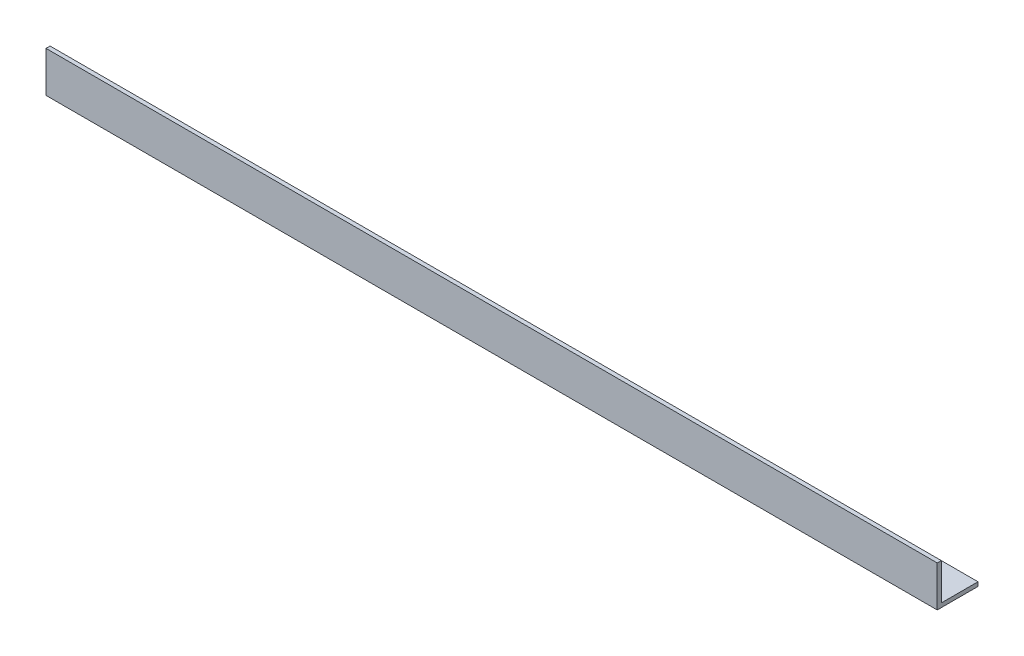
ISO-10303-21;
HEADER;
FILE_DESCRIPTION(('STEP AP214'),'2;1');
FILE_NAME('part.step','',(''),(''),'','','');
FILE_SCHEMA(('AUTOMOTIVE_DESIGN { 1 0 10303 214 1 1 1 1 }'));
ENDSEC;
DATA;
#1=APPLICATION_CONTEXT('core data for automotive mechanical design processes');
#2=APPLICATION_PROTOCOL_DEFINITION('international standard','automotive_design',2000,#1);
#3=PRODUCT_CONTEXT('',#1,'mechanical');
#4=PRODUCT('Part','Part','',(#3));
#5=PRODUCT_RELATED_PRODUCT_CATEGORY('part','',(#4));
#6=PRODUCT_DEFINITION_FORMATION('','',#4);
#7=PRODUCT_DEFINITION_CONTEXT('part definition',#1,'design');
#8=PRODUCT_DEFINITION('design','',#6,#7);
#9=PRODUCT_DEFINITION_SHAPE('','',#8);
#10=(LENGTH_UNIT() NAMED_UNIT(*) SI_UNIT(.MILLI.,.METRE.));
#11=(NAMED_UNIT(*) PLANE_ANGLE_UNIT() SI_UNIT($,.RADIAN.));
#12=(NAMED_UNIT(*) SI_UNIT($,.STERADIAN.) SOLID_ANGLE_UNIT());
#13=UNCERTAINTY_MEASURE_WITH_UNIT(LENGTH_MEASURE(1.E-05),#10,'distance_accuracy_value','');
#14=(GEOMETRIC_REPRESENTATION_CONTEXT(3) GLOBAL_UNCERTAINTY_ASSIGNED_CONTEXT((#13)) GLOBAL_UNIT_ASSIGNED_CONTEXT((#10,
#11,#12)) REPRESENTATION_CONTEXT('',''));
#15=CARTESIAN_POINT('',(0.,0.,0.));
#16=DIRECTION('',(0.,0.,1.));
#17=DIRECTION('',(1.,0.,0.));
#18=AXIS2_PLACEMENT_3D('',#15,#16,#17);
#19=CARTESIAN_POINT('',(328.,0.,-15.));
#20=DIRECTION('',(0.,1.,0.));
#21=DIRECTION('',(0.,0.,1.));
#22=AXIS2_PLACEMENT_3D('',#19,#20,#21);
#23=PLANE('',#22);
#24=DIRECTION('',(0.,0.,-1.));
#25=VECTOR('',#24,1.);
#26=CARTESIAN_POINT('',(0.,0.,-15.));
#27=LINE('',#26,#25);
#28=CARTESIAN_POINT('',(0.,0.,0.));
#29=VERTEX_POINT('',#28);
#30=CARTESIAN_POINT('',(0.,0.,-15.));
#31=VERTEX_POINT('',#30);
#32=EDGE_CURVE('E118',#29,#31,#27,.T.);
#33=ORIENTED_EDGE('',*,*,#32,.T.);
#34=DIRECTION('',(-1.,0.,0.));
#35=VECTOR('',#34,1.);
#36=CARTESIAN_POINT('',(328.,0.,-15.));
#37=LINE('',#36,#35);
#38=CARTESIAN_POINT('',(328.,0.,-15.));
#39=VERTEX_POINT('',#38);
#40=EDGE_CURVE('E11',#39,#31,#37,.T.);
#41=ORIENTED_EDGE('',*,*,#40,.F.);
#42=DIRECTION('',(0.,0.,-1.));
#43=VECTOR('',#42,1.);
#44=CARTESIAN_POINT('',(328.,0.,-15.));
#45=LINE('',#44,#43);
#46=CARTESIAN_POINT('',(328.,0.,0.));
#47=VERTEX_POINT('',#46);
#48=EDGE_CURVE('E128',#47,#39,#45,.T.);
#49=ORIENTED_EDGE('',*,*,#48,.F.);
#50=DIRECTION('',(-1.,0.,0.));
#51=VECTOR('',#50,1.);
#52=CARTESIAN_POINT('',(328.,0.,0.));
#53=LINE('',#52,#51);
#54=EDGE_CURVE('E114',#47,#29,#53,.T.);
#55=ORIENTED_EDGE('',*,*,#54,.T.);
#56=EDGE_LOOP('',(#33,#41,#49,#55));
#57=FACE_BOUND('',#56,.T.);
#58=ADVANCED_FACE('F34',(#57),#23,.F.);
#59=CARTESIAN_POINT('',(328.,1.49999999999998,-15.));
#60=DIRECTION('',(0.,0.,1.));
#61=DIRECTION('',(1.,0.,0.));
#62=AXIS2_PLACEMENT_3D('',#59,#60,#61);
#63=PLANE('',#62);
#64=DIRECTION('',(0.,1.,0.));
#65=VECTOR('',#64,1.);
#66=CARTESIAN_POINT('',(0.,1.49999999999998,-15.));
#67=LINE('',#66,#65);
#68=CARTESIAN_POINT('',(0.,1.49999999999998,-15.));
#69=VERTEX_POINT('',#68);
#70=EDGE_CURVE('E121',#31,#69,#67,.T.);
#71=ORIENTED_EDGE('',*,*,#70,.T.);
#72=DIRECTION('',(-1.,0.,0.));
#73=VECTOR('',#72,1.);
#74=CARTESIAN_POINT('',(328.,1.49999999999998,-15.));
#75=LINE('',#74,#73);
#76=CARTESIAN_POINT('',(328.,1.49999999999998,-15.));
#77=VERTEX_POINT('',#76);
#78=EDGE_CURVE('E42',#77,#69,#75,.T.);
#79=ORIENTED_EDGE('',*,*,#78,.F.);
#80=DIRECTION('',(0.,1.,0.));
#81=VECTOR('',#80,1.);
#82=CARTESIAN_POINT('',(328.,1.49999999999998,-15.));
#83=LINE('',#82,#81);
#84=EDGE_CURVE('E87',#39,#77,#83,.T.);
#85=ORIENTED_EDGE('',*,*,#84,.F.);
#86=ORIENTED_EDGE('',*,*,#40,.T.);
#87=EDGE_LOOP('',(#71,#79,#85,#86));
#88=FACE_BOUND('',#87,.T.);
#89=ADVANCED_FACE('F152',(#88),#63,.F.);
#90=CARTESIAN_POINT('',(328.,1.5,-1.50000000000002));
#91=DIRECTION('',(0.,-1.,0.));
#92=DIRECTION('',(0.,0.,-1.));
#93=AXIS2_PLACEMENT_3D('',#90,#91,#92);
#94=PLANE('',#93);
#95=DIRECTION('',(0.,0.,1.));
#96=VECTOR('',#95,1.);
#97=CARTESIAN_POINT('',(0.,1.5,-1.50000000000002));
#98=LINE('',#97,#96);
#99=CARTESIAN_POINT('',(0.,1.5,-1.50000000000002));
#100=VERTEX_POINT('',#99);
#101=EDGE_CURVE('E123',#69,#100,#98,.T.);
#102=ORIENTED_EDGE('',*,*,#101,.T.);
#103=DIRECTION('',(-1.,0.,0.));
#104=VECTOR('',#103,1.);
#105=CARTESIAN_POINT('',(328.,1.5,-1.50000000000002));
#106=LINE('',#105,#104);
#107=CARTESIAN_POINT('',(328.,1.5,-1.50000000000002));
#108=VERTEX_POINT('',#107);
#109=EDGE_CURVE('E109',#108,#100,#106,.T.);
#110=ORIENTED_EDGE('',*,*,#109,.F.);
#111=DIRECTION('',(0.,0.,1.));
#112=VECTOR('',#111,1.);
#113=CARTESIAN_POINT('',(328.,1.5,-1.50000000000002));
#114=LINE('',#113,#112);
#115=EDGE_CURVE('E100',#77,#108,#114,.T.);
#116=ORIENTED_EDGE('',*,*,#115,.F.);
#117=ORIENTED_EDGE('',*,*,#78,.T.);
#118=EDGE_LOOP('',(#102,#110,#116,#117));
#119=FACE_BOUND('',#118,.T.);
#120=ADVANCED_FACE('F134',(#119),#94,.F.);
#121=CARTESIAN_POINT('',(328.,15.,-1.5));
#122=DIRECTION('',(0.,0.,1.));
#123=DIRECTION('',(0.,-1.,0.));
#124=AXIS2_PLACEMENT_3D('',#121,#122,#123);
#125=PLANE('',#124);
#126=DIRECTION('',(0.,1.,0.));
#127=VECTOR('',#126,1.);
#128=CARTESIAN_POINT('',(0.,15.,-1.5));
#129=LINE('',#128,#127);
#130=CARTESIAN_POINT('',(0.,15.,-1.5));
#131=VERTEX_POINT('',#130);
#132=EDGE_CURVE('E108',#100,#131,#129,.T.);
#133=ORIENTED_EDGE('',*,*,#132,.T.);
#134=DIRECTION('',(-1.,0.,0.));
#135=VECTOR('',#134,1.);
#136=CARTESIAN_POINT('',(328.,15.,-1.5));
#137=LINE('',#136,#135);
#138=CARTESIAN_POINT('',(328.,15.,-1.5));
#139=VERTEX_POINT('',#138);
#140=EDGE_CURVE('E105',#139,#131,#137,.T.);
#141=ORIENTED_EDGE('',*,*,#140,.F.);
#142=DIRECTION('',(0.,1.,0.));
#143=VECTOR('',#142,1.);
#144=CARTESIAN_POINT('',(328.,15.,-1.5));
#145=LINE('',#144,#143);
#146=EDGE_CURVE('E94',#108,#139,#145,.T.);
#147=ORIENTED_EDGE('',*,*,#146,.F.);
#148=ORIENTED_EDGE('',*,*,#109,.T.);
#149=EDGE_LOOP('',(#133,#141,#147,#148));
#150=FACE_BOUND('',#149,.T.);
#151=ADVANCED_FACE('F106',(#150),#125,.F.);
#152=CARTESIAN_POINT('',(328.,15.,0.));
#153=DIRECTION('',(0.,-1.,0.));
#154=DIRECTION('',(0.,0.,-1.));
#155=AXIS2_PLACEMENT_3D('',#152,#153,#154);
#156=PLANE('',#155);
#157=DIRECTION('',(0.,0.,1.));
#158=VECTOR('',#157,1.);
#159=CARTESIAN_POINT('',(0.,15.,0.));
#160=LINE('',#159,#158);
#161=CARTESIAN_POINT('',(0.,15.,0.));
#162=VERTEX_POINT('',#161);
#163=EDGE_CURVE('E73',#131,#162,#160,.T.);
#164=ORIENTED_EDGE('',*,*,#163,.T.);
#165=DIRECTION('',(-1.,0.,0.));
#166=VECTOR('',#165,1.);
#167=CARTESIAN_POINT('',(328.,15.,0.));
#168=LINE('',#167,#166);
#169=CARTESIAN_POINT('',(328.,15.,0.));
#170=VERTEX_POINT('',#169);
#171=EDGE_CURVE('E110',#170,#162,#168,.T.);
#172=ORIENTED_EDGE('',*,*,#171,.F.);
#173=DIRECTION('',(0.,0.,1.));
#174=VECTOR('',#173,1.);
#175=CARTESIAN_POINT('',(328.,15.,0.));
#176=LINE('',#175,#174);
#177=EDGE_CURVE('E98',#139,#170,#176,.T.);
#178=ORIENTED_EDGE('',*,*,#177,.F.);
#179=ORIENTED_EDGE('',*,*,#140,.T.);
#180=EDGE_LOOP('',(#164,#172,#178,#179));
#181=FACE_BOUND('',#180,.T.);
#182=ADVANCED_FACE('F112',(#181),#156,.F.);
#183=CARTESIAN_POINT('',(328.,0.,0.));
#184=DIRECTION('',(0.,0.,-1.));
#185=DIRECTION('',(-1.,0.,0.));
#186=AXIS2_PLACEMENT_3D('',#183,#184,#185);
#187=PLANE('',#186);
#188=DIRECTION('',(0.,-1.,0.));
#189=VECTOR('',#188,1.);
#190=CARTESIAN_POINT('',(0.,0.,0.));
#191=LINE('',#190,#189);
#192=EDGE_CURVE('E79',#162,#29,#191,.T.);
#193=ORIENTED_EDGE('',*,*,#192,.T.);
#194=ORIENTED_EDGE('',*,*,#54,.F.);
#195=DIRECTION('',(0.,-1.,0.));
#196=VECTOR('',#195,1.);
#197=CARTESIAN_POINT('',(328.,0.,0.));
#198=LINE('',#197,#196);
#199=EDGE_CURVE('E50',#170,#47,#198,.T.);
#200=ORIENTED_EDGE('',*,*,#199,.F.);
#201=ORIENTED_EDGE('',*,*,#171,.T.);
#202=EDGE_LOOP('',(#193,#194,#200,#201));
#203=FACE_BOUND('',#202,.T.);
#204=ADVANCED_FACE('F141',(#203),#187,.F.);
#205=CARTESIAN_POINT('',(328.,0.,0.));
#206=DIRECTION('',(-1.,0.,0.));
#207=DIRECTION('',(0.,0.,1.));
#208=AXIS2_PLACEMENT_3D('',#205,#206,#207);
#209=PLANE('',#208);
#210=ORIENTED_EDGE('',*,*,#48,.T.);
#211=ORIENTED_EDGE('',*,*,#84,.T.);
#212=ORIENTED_EDGE('',*,*,#115,.T.);
#213=ORIENTED_EDGE('',*,*,#146,.T.);
#214=ORIENTED_EDGE('',*,*,#177,.T.);
#215=ORIENTED_EDGE('',*,*,#199,.T.);
#216=EDGE_LOOP('',(#210,#211,#212,#213,#214,#215));
#217=FACE_BOUND('',#216,.T.);
#218=ADVANCED_FACE('F96',(#217),#209,.F.);
#219=CARTESIAN_POINT('',(0.,0.,0.));
#220=DIRECTION('',(-1.,0.,0.));
#221=DIRECTION('',(0.,0.,1.));
#222=AXIS2_PLACEMENT_3D('',#219,#220,#221);
#223=PLANE('',#222);
#224=ORIENTED_EDGE('',*,*,#32,.F.);
#225=ORIENTED_EDGE('',*,*,#192,.F.);
#226=ORIENTED_EDGE('',*,*,#163,.F.);
#227=ORIENTED_EDGE('',*,*,#132,.F.);
#228=ORIENTED_EDGE('',*,*,#101,.F.);
#229=ORIENTED_EDGE('',*,*,#70,.F.);
#230=EDGE_LOOP('',(#224,#225,#226,#227,#228,#229));
#231=FACE_BOUND('',#230,.T.);
#232=ADVANCED_FACE('F137',(#231),#223,.T.);
#233=CLOSED_SHELL('',(#58,#89,#120,#151,#182,#204,#218,#232));
#234=MANIFOLD_SOLID_BREP('B2',#233);
#235=ADVANCED_BREP_SHAPE_REPRESENTATION('',(#18,#234),#14);
#236=SHAPE_DEFINITION_REPRESENTATION(#9,#235);
ENDSEC;
END-ISO-10303-21;
